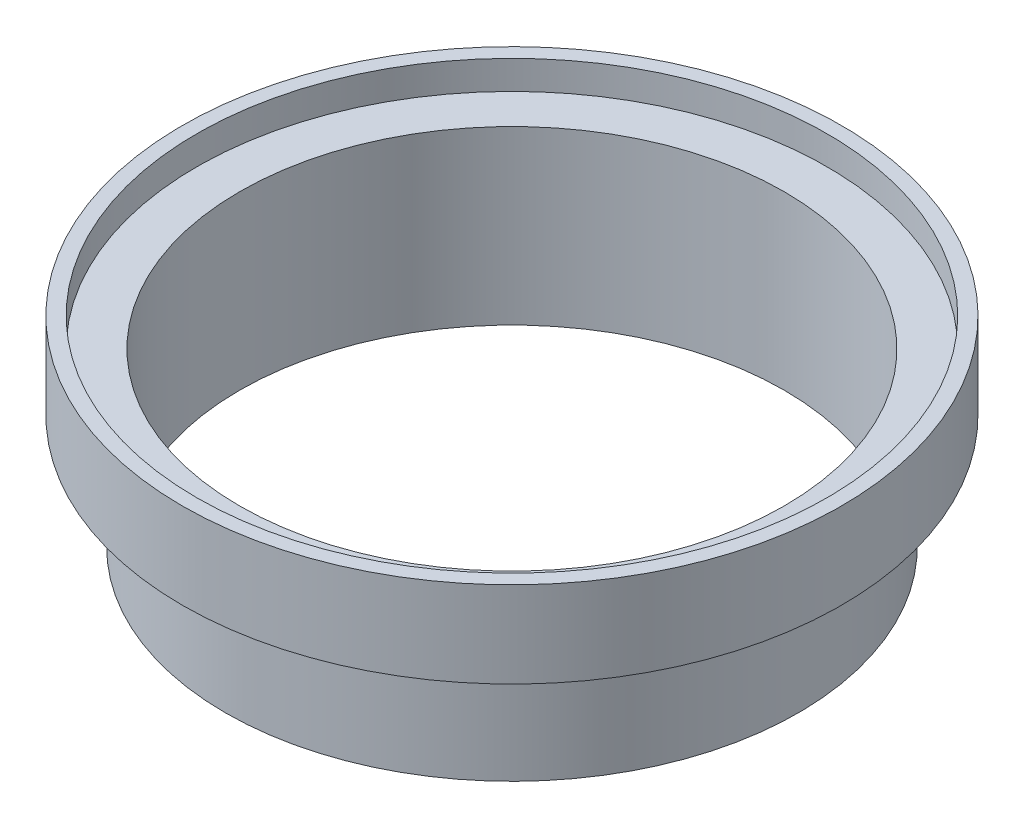
ISO-10303-21;
HEADER;
FILE_DESCRIPTION(('STEP AP214'),'2;1');
FILE_NAME('part.step','',(''),(''),'','','');
FILE_SCHEMA(('AUTOMOTIVE_DESIGN { 1 0 10303 214 1 1 1 1 }'));
ENDSEC;
DATA;
#1=APPLICATION_CONTEXT('core data for automotive mechanical design processes');
#2=APPLICATION_PROTOCOL_DEFINITION('international standard','automotive_design',2000,#1);
#3=PRODUCT_CONTEXT('',#1,'mechanical');
#4=PRODUCT('Part','Part','',(#3));
#5=PRODUCT_RELATED_PRODUCT_CATEGORY('part','',(#4));
#6=PRODUCT_DEFINITION_FORMATION('','',#4);
#7=PRODUCT_DEFINITION_CONTEXT('part definition',#1,'design');
#8=PRODUCT_DEFINITION('design','',#6,#7);
#9=PRODUCT_DEFINITION_SHAPE('','',#8);
#10=(LENGTH_UNIT() NAMED_UNIT(*) SI_UNIT(.MILLI.,.METRE.));
#11=(NAMED_UNIT(*) PLANE_ANGLE_UNIT() SI_UNIT($,.RADIAN.));
#12=(NAMED_UNIT(*) SI_UNIT($,.STERADIAN.) SOLID_ANGLE_UNIT());
#13=UNCERTAINTY_MEASURE_WITH_UNIT(LENGTH_MEASURE(1.E-05),#10,'distance_accuracy_value','');
#14=(GEOMETRIC_REPRESENTATION_CONTEXT(3) GLOBAL_UNCERTAINTY_ASSIGNED_CONTEXT((#13)) GLOBAL_UNIT_ASSIGNED_CONTEXT((#10,
#11,#12)) REPRESENTATION_CONTEXT('',''));
#15=CARTESIAN_POINT('',(0.,0.,0.));
#16=DIRECTION('',(0.,0.,1.));
#17=DIRECTION('',(1.,0.,0.));
#18=AXIS2_PLACEMENT_3D('',#15,#16,#17);
#19=CARTESIAN_POINT('',(-60.325,0.,0.));
#20=DIRECTION('',(0.,-1.,0.));
#21=DIRECTION('',(0.,0.,-1.));
#22=AXIS2_PLACEMENT_3D('',#19,#20,#21);
#23=PLANE('',#22);
#24=CARTESIAN_POINT('',(0.,0.,0.));
#25=DIRECTION('',(0.,1.,0.));
#26=DIRECTION('',(0.,0.,1.));
#27=AXIS2_PLACEMENT_3D('',#24,#25,#26);
#28=CIRCLE('',#27,60.325);
#29=CARTESIAN_POINT('',(0.,0.,60.325));
#30=VERTEX_POINT('',#29);
#31=EDGE_CURVE('E59',#30,#30,#28,.T.);
#32=ORIENTED_EDGE('',*,*,#31,.T.);
#33=EDGE_LOOP('',(#32));
#34=FACE_BOUND('',#33,.T.);
#35=CARTESIAN_POINT('',(0.,0.,0.));
#36=DIRECTION('',(0.,1.,0.));
#37=DIRECTION('',(0.,0.,1.));
#38=AXIS2_PLACEMENT_3D('',#35,#36,#37);
#39=CIRCLE('',#38,63.5);
#40=CARTESIAN_POINT('',(0.,0.,63.5));
#41=VERTEX_POINT('',#40);
#42=EDGE_CURVE('E10',#41,#41,#39,.T.);
#43=ORIENTED_EDGE('',*,*,#42,.F.);
#44=EDGE_LOOP('',(#43));
#45=FACE_BOUND('',#44,.T.);
#46=ADVANCED_FACE('F31',(#34,#45),#23,.T.);
#47=CARTESIAN_POINT('',(0.,65.052154419169,0.));
#48=DIRECTION('',(0.,1.,0.));
#49=DIRECTION('',(0.,0.,1.));
#50=AXIS2_PLACEMENT_3D('',#47,#48,#49);
#51=CYLINDRICAL_SURFACE('',#50,63.5);
#52=ORIENTED_EDGE('',*,*,#42,.T.);
#53=EDGE_LOOP('',(#52));
#54=FACE_BOUND('',#53,.T.);
#55=CARTESIAN_POINT('',(0.,25.4,0.));
#56=DIRECTION('',(0.,1.,0.));
#57=DIRECTION('',(0.,0.,1.));
#58=AXIS2_PLACEMENT_3D('',#55,#56,#57);
#59=CIRCLE('',#58,63.5);
#60=CARTESIAN_POINT('',(0.,25.4,63.5));
#61=VERTEX_POINT('',#60);
#62=EDGE_CURVE('E37',#61,#61,#59,.T.);
#63=ORIENTED_EDGE('',*,*,#62,.F.);
#64=EDGE_LOOP('',(#63));
#65=FACE_BOUND('',#64,.T.);
#66=ADVANCED_FACE('F77',(#54,#65),#51,.T.);
#67=CARTESIAN_POINT('',(-63.5,25.4,0.));
#68=DIRECTION('',(0.,-1.,0.));
#69=DIRECTION('',(0.,0.,-1.));
#70=AXIS2_PLACEMENT_3D('',#67,#68,#69);
#71=PLANE('',#70);
#72=ORIENTED_EDGE('',*,*,#62,.T.);
#73=EDGE_LOOP('',(#72));
#74=FACE_BOUND('',#73,.T.);
#75=CARTESIAN_POINT('',(0.,25.4,0.));
#76=DIRECTION('',(0.,1.,0.));
#77=DIRECTION('',(0.,0.,1.));
#78=AXIS2_PLACEMENT_3D('',#75,#76,#77);
#79=CIRCLE('',#78,73.025);
#80=CARTESIAN_POINT('',(0.,25.4,73.025));
#81=VERTEX_POINT('',#80);
#82=EDGE_CURVE('E41',#81,#81,#79,.T.);
#83=ORIENTED_EDGE('',*,*,#82,.F.);
#84=EDGE_LOOP('',(#83));
#85=FACE_BOUND('',#84,.T.);
#86=ADVANCED_FACE('F81',(#74,#85),#71,.T.);
#87=CARTESIAN_POINT('',(0.,65.052154419169,0.));
#88=DIRECTION('',(0.,1.,0.));
#89=DIRECTION('',(0.,0.,1.));
#90=AXIS2_PLACEMENT_3D('',#87,#88,#89);
#91=CYLINDRICAL_SURFACE('',#90,73.025);
#92=ORIENTED_EDGE('',*,*,#82,.T.);
#93=EDGE_LOOP('',(#92));
#94=FACE_BOUND('',#93,.T.);
#95=CARTESIAN_POINT('',(0.,44.45,0.));
#96=DIRECTION('',(0.,1.,0.));
#97=DIRECTION('',(0.,0.,1.));
#98=AXIS2_PLACEMENT_3D('',#95,#96,#97);
#99=CIRCLE('',#98,73.025);
#100=CARTESIAN_POINT('',(0.,44.45,73.025));
#101=VERTEX_POINT('',#100);
#102=EDGE_CURVE('E45',#101,#101,#99,.T.);
#103=ORIENTED_EDGE('',*,*,#102,.F.);
#104=EDGE_LOOP('',(#103));
#105=FACE_BOUND('',#104,.T.);
#106=ADVANCED_FACE('F85',(#94,#105),#91,.T.);
#107=CARTESIAN_POINT('',(-73.025,44.45,0.));
#108=DIRECTION('',(0.,1.,0.));
#109=DIRECTION('',(0.,0.,1.));
#110=AXIS2_PLACEMENT_3D('',#107,#108,#109);
#111=PLANE('',#110);
#112=ORIENTED_EDGE('',*,*,#102,.T.);
#113=EDGE_LOOP('',(#112));
#114=FACE_BOUND('',#113,.T.);
#115=CARTESIAN_POINT('',(0.,44.45,0.));
#116=DIRECTION('',(0.,1.,0.));
#117=DIRECTION('',(0.,0.,1.));
#118=AXIS2_PLACEMENT_3D('',#115,#116,#117);
#119=CIRCLE('',#118,69.85);
#120=CARTESIAN_POINT('',(0.,44.45,69.85));
#121=VERTEX_POINT('',#120);
#122=EDGE_CURVE('E50',#121,#121,#119,.T.);
#123=ORIENTED_EDGE('',*,*,#122,.F.);
#124=EDGE_LOOP('',(#123));
#125=FACE_BOUND('',#124,.T.);
#126=ADVANCED_FACE('F91',(#114,#125),#111,.T.);
#127=CARTESIAN_POINT('',(0.,65.052154419169,0.));
#128=DIRECTION('',(0.,1.,0.));
#129=DIRECTION('',(0.,0.,1.));
#130=AXIS2_PLACEMENT_3D('',#127,#128,#129);
#131=CYLINDRICAL_SURFACE('',#130,69.85);
#132=ORIENTED_EDGE('',*,*,#122,.T.);
#133=EDGE_LOOP('',(#132));
#134=FACE_BOUND('',#133,.T.);
#135=CARTESIAN_POINT('',(0.,38.1,0.));
#136=DIRECTION('',(0.,1.,0.));
#137=DIRECTION('',(0.,0.,1.));
#138=AXIS2_PLACEMENT_3D('',#135,#136,#137);
#139=CIRCLE('',#138,69.85);
#140=CARTESIAN_POINT('',(0.,38.1,69.85));
#141=VERTEX_POINT('',#140);
#142=EDGE_CURVE('E53',#141,#141,#139,.T.);
#143=ORIENTED_EDGE('',*,*,#142,.F.);
#144=EDGE_LOOP('',(#143));
#145=FACE_BOUND('',#144,.T.);
#146=ADVANCED_FACE('F73',(#134,#145),#131,.F.);
#147=CARTESIAN_POINT('',(-69.85,38.1,0.));
#148=DIRECTION('',(0.,1.,0.));
#149=DIRECTION('',(0.,0.,1.));
#150=AXIS2_PLACEMENT_3D('',#147,#148,#149);
#151=PLANE('',#150);
#152=ORIENTED_EDGE('',*,*,#142,.T.);
#153=EDGE_LOOP('',(#152));
#154=FACE_BOUND('',#153,.T.);
#155=CARTESIAN_POINT('',(0.,38.1,0.));
#156=DIRECTION('',(0.,1.,0.));
#157=DIRECTION('',(0.,0.,1.));
#158=AXIS2_PLACEMENT_3D('',#155,#156,#157);
#159=CIRCLE('',#158,60.325);
#160=CARTESIAN_POINT('',(0.,38.1,60.325));
#161=VERTEX_POINT('',#160);
#162=EDGE_CURVE('E56',#161,#161,#159,.T.);
#163=ORIENTED_EDGE('',*,*,#162,.F.);
#164=EDGE_LOOP('',(#163));
#165=FACE_BOUND('',#164,.T.);
#166=ADVANCED_FACE('F67',(#154,#165),#151,.T.);
#167=CARTESIAN_POINT('',(0.,65.052154419169,0.));
#168=DIRECTION('',(0.,1.,0.));
#169=DIRECTION('',(0.,0.,1.));
#170=AXIS2_PLACEMENT_3D('',#167,#168,#169);
#171=CYLINDRICAL_SURFACE('',#170,60.325);
#172=ORIENTED_EDGE('',*,*,#162,.T.);
#173=EDGE_LOOP('',(#172));
#174=FACE_BOUND('',#173,.T.);
#175=ORIENTED_EDGE('',*,*,#31,.F.);
#176=EDGE_LOOP('',(#175));
#177=FACE_BOUND('',#176,.T.);
#178=ADVANCED_FACE('F65',(#174,#177),#171,.F.);
#179=CLOSED_SHELL('',(#46,#66,#86,#106,#126,#146,#166,#178));
#180=MANIFOLD_SOLID_BREP('B2',#179);
#181=ADVANCED_BREP_SHAPE_REPRESENTATION('',(#18,#180),#14);
#182=SHAPE_DEFINITION_REPRESENTATION(#9,#181);
ENDSEC;
END-ISO-10303-21;
